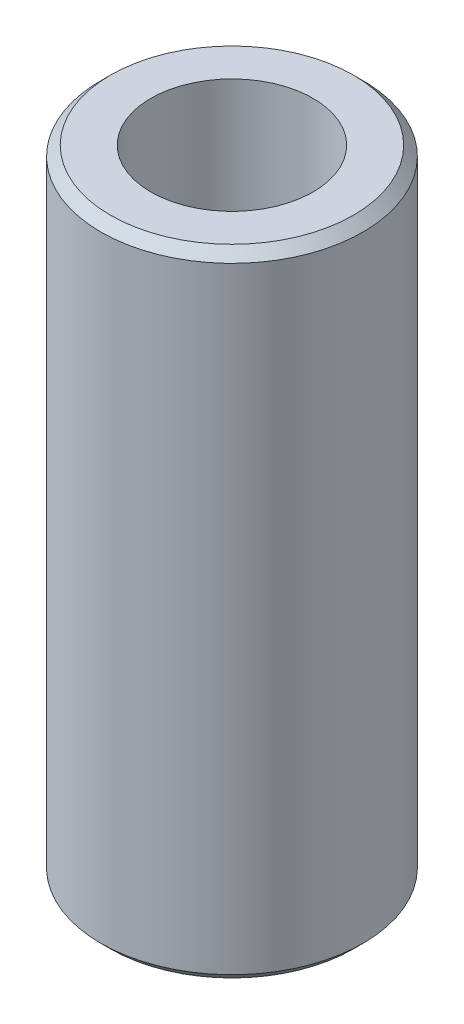
ISO-10303-21;
HEADER;
FILE_DESCRIPTION(('STEP AP214'),'2;1');
FILE_NAME('part.step','',(''),(''),'','','');
FILE_SCHEMA(('AUTOMOTIVE_DESIGN { 1 0 10303 214 1 1 1 1 }'));
ENDSEC;
DATA;
#1=APPLICATION_CONTEXT('core data for automotive mechanical design processes');
#2=APPLICATION_PROTOCOL_DEFINITION('international standard','automotive_design',2000,#1);
#3=PRODUCT_CONTEXT('',#1,'mechanical');
#4=PRODUCT('Part','Part','',(#3));
#5=PRODUCT_RELATED_PRODUCT_CATEGORY('part','',(#4));
#6=PRODUCT_DEFINITION_FORMATION('','',#4);
#7=PRODUCT_DEFINITION_CONTEXT('part definition',#1,'design');
#8=PRODUCT_DEFINITION('design','',#6,#7);
#9=PRODUCT_DEFINITION_SHAPE('','',#8);
#10=(LENGTH_UNIT() NAMED_UNIT(*) SI_UNIT(.MILLI.,.METRE.));
#11=(NAMED_UNIT(*) PLANE_ANGLE_UNIT() SI_UNIT($,.RADIAN.));
#12=(NAMED_UNIT(*) SI_UNIT($,.STERADIAN.) SOLID_ANGLE_UNIT());
#13=UNCERTAINTY_MEASURE_WITH_UNIT(LENGTH_MEASURE(1.E-05),#10,'distance_accuracy_value','');
#14=(GEOMETRIC_REPRESENTATION_CONTEXT(3) GLOBAL_UNCERTAINTY_ASSIGNED_CONTEXT((#13)) GLOBAL_UNIT_ASSIGNED_CONTEXT((#10,
#11,#12)) REPRESENTATION_CONTEXT('',''));
#15=CARTESIAN_POINT('',(0.,0.,0.));
#16=DIRECTION('',(0.,0.,1.));
#17=DIRECTION('',(1.,0.,0.));
#18=AXIS2_PLACEMENT_3D('',#15,#16,#17);
#19=CARTESIAN_POINT('',(0.,230.184533354212,0.));
#20=DIRECTION('',(0.,-1.,0.));
#21=DIRECTION('',(0.,0.,-1.));
#22=AXIS2_PLACEMENT_3D('',#19,#20,#21);
#23=CYLINDRICAL_SURFACE('',#22,47.5);
#24=CARTESIAN_POINT('',(0.,226.677115931484,0.));
#25=DIRECTION('',(0.,1.,0.));
#26=DIRECTION('',(0.,0.,1.));
#27=AXIS2_PLACEMENT_3D('',#24,#25,#26);
#28=CIRCLE('',#27,47.5);
#29=CARTESIAN_POINT('',(0.,226.677115931484,47.5));
#30=VERTEX_POINT('',#29);
#31=EDGE_CURVE('E50',#30,#30,#28,.F.);
#32=ORIENTED_EDGE('',*,*,#31,.T.);
#33=EDGE_LOOP('',(#32));
#34=FACE_BOUND('',#33,.T.);
#35=CARTESIAN_POINT('',(0.,3.50741742272798,0.));
#36=DIRECTION('',(0.,1.,0.));
#37=DIRECTION('',(0.,0.,1.));
#38=AXIS2_PLACEMENT_3D('',#35,#36,#37);
#39=CIRCLE('',#38,47.5);
#40=CARTESIAN_POINT('',(0.,3.50741742272798,47.5));
#41=VERTEX_POINT('',#40);
#42=EDGE_CURVE('E51',#41,#41,#39,.T.);
#43=ORIENTED_EDGE('',*,*,#42,.T.);
#44=EDGE_LOOP('',(#43));
#45=FACE_BOUND('',#44,.T.);
#46=ADVANCED_FACE('F39',(#34,#45),#23,.T.);
#47=CARTESIAN_POINT('',(0.,230.184533354212,0.));
#48=DIRECTION('',(0.,1.,0.));
#49=DIRECTION('',(0.,0.,1.));
#50=AXIS2_PLACEMENT_3D('',#47,#48,#49);
#51=PLANE('',#50);
#52=CARTESIAN_POINT('',(0.,230.184533354212,0.));
#53=DIRECTION('',(0.,1.,0.));
#54=DIRECTION('',(0.,0.,1.));
#55=AXIS2_PLACEMENT_3D('',#52,#53,#54);
#56=CIRCLE('',#55,43.992582577272);
#57=CARTESIAN_POINT('',(0.,230.184533354212,43.992582577272));
#58=VERTEX_POINT('',#57);
#59=EDGE_CURVE('E54',#58,#58,#56,.T.);
#60=ORIENTED_EDGE('',*,*,#59,.T.);
#61=EDGE_LOOP('',(#60));
#62=FACE_BOUND('',#61,.T.);
#63=CARTESIAN_POINT('',(0.,230.184533354212,0.));
#64=DIRECTION('',(0.,1.,0.));
#65=DIRECTION('',(0.,0.,1.));
#66=AXIS2_PLACEMENT_3D('',#63,#64,#65);
#67=CIRCLE('',#66,29.398157420627);
#68=CARTESIAN_POINT('',(0.,230.184533354212,29.398157420627));
#69=VERTEX_POINT('',#68);
#70=EDGE_CURVE('E58',#69,#69,#67,.T.);
#71=ORIENTED_EDGE('',*,*,#70,.F.);
#72=EDGE_LOOP('',(#71));
#73=FACE_BOUND('',#72,.T.);
#74=ADVANCED_FACE('F69',(#62,#73),#51,.T.);
#75=CARTESIAN_POINT('',(0.,0.,0.));
#76=DIRECTION('',(0.,1.,0.));
#77=DIRECTION('',(0.,0.,1.));
#78=AXIS2_PLACEMENT_3D('',#75,#76,#77);
#79=PLANE('',#78);
#80=CARTESIAN_POINT('',(0.,0.,0.));
#81=DIRECTION('',(0.,1.,0.));
#82=DIRECTION('',(0.,0.,1.));
#83=AXIS2_PLACEMENT_3D('',#80,#81,#82);
#84=CIRCLE('',#83,43.992582577272);
#85=CARTESIAN_POINT('',(0.,0.,43.992582577272));
#86=VERTEX_POINT('',#85);
#87=EDGE_CURVE('E10',#86,#86,#84,.F.);
#88=ORIENTED_EDGE('',*,*,#87,.T.);
#89=EDGE_LOOP('',(#88));
#90=FACE_BOUND('',#89,.T.);
#91=CARTESIAN_POINT('',(0.,0.,0.));
#92=DIRECTION('',(0.,1.,0.));
#93=DIRECTION('',(0.,0.,1.));
#94=AXIS2_PLACEMENT_3D('',#91,#92,#93);
#95=CIRCLE('',#94,29.398157420627);
#96=CARTESIAN_POINT('',(0.,0.,29.398157420627));
#97=VERTEX_POINT('',#96);
#98=EDGE_CURVE('E63',#97,#97,#95,.T.);
#99=ORIENTED_EDGE('',*,*,#98,.T.);
#100=EDGE_LOOP('',(#99));
#101=FACE_BOUND('',#100,.T.);
#102=ADVANCED_FACE('F75',(#90,#101),#79,.F.);
#103=CARTESIAN_POINT('',(0.,230.184533354212,0.));
#104=DIRECTION('',(0.,-1.,0.));
#105=DIRECTION('',(0.,0.,-1.));
#106=AXIS2_PLACEMENT_3D('',#103,#104,#105);
#107=CYLINDRICAL_SURFACE('',#106,29.398157420627);
#108=ORIENTED_EDGE('',*,*,#70,.T.);
#109=EDGE_LOOP('',(#108));
#110=FACE_BOUND('',#109,.T.);
#111=ORIENTED_EDGE('',*,*,#98,.F.);
#112=EDGE_LOOP('',(#111));
#113=FACE_BOUND('',#112,.T.);
#114=ADVANCED_FACE('F70',(#110,#113),#107,.F.);
#115=CARTESIAN_POINT('',(0.,230.184533354212,0.));
#116=DIRECTION('',(0.,-1.,0.));
#117=DIRECTION('',(0.,0.,-1.));
#118=AXIS2_PLACEMENT_3D('',#115,#116,#117);
#119=CONICAL_SURFACE('',#118,43.992582577272,0.785398163397448);
#120=ORIENTED_EDGE('',*,*,#31,.F.);
#121=EDGE_LOOP('',(#120));
#122=FACE_BOUND('',#121,.T.);
#123=ORIENTED_EDGE('',*,*,#59,.F.);
#124=EDGE_LOOP('',(#123));
#125=FACE_BOUND('',#124,.T.);
#126=ADVANCED_FACE('F81',(#122,#125),#119,.T.);
#127=CARTESIAN_POINT('',(0.,3.50741742272798,0.));
#128=DIRECTION('',(0.,1.,0.));
#129=DIRECTION('',(0.,0.,1.));
#130=AXIS2_PLACEMENT_3D('',#127,#128,#129);
#131=CONICAL_SURFACE('',#130,47.5,0.785398163397451);
#132=ORIENTED_EDGE('',*,*,#87,.F.);
#133=EDGE_LOOP('',(#132));
#134=FACE_BOUND('',#133,.T.);
#135=ORIENTED_EDGE('',*,*,#42,.F.);
#136=EDGE_LOOP('',(#135));
#137=FACE_BOUND('',#136,.T.);
#138=ADVANCED_FACE('F45',(#134,#137),#131,.T.);
#139=CLOSED_SHELL('',(#46,#74,#102,#114,#126,#138));
#140=MANIFOLD_SOLID_BREP('B2',#139);
#141=ADVANCED_BREP_SHAPE_REPRESENTATION('',(#18,#140),#14);
#142=SHAPE_DEFINITION_REPRESENTATION(#9,#141);
ENDSEC;
END-ISO-10303-21;
